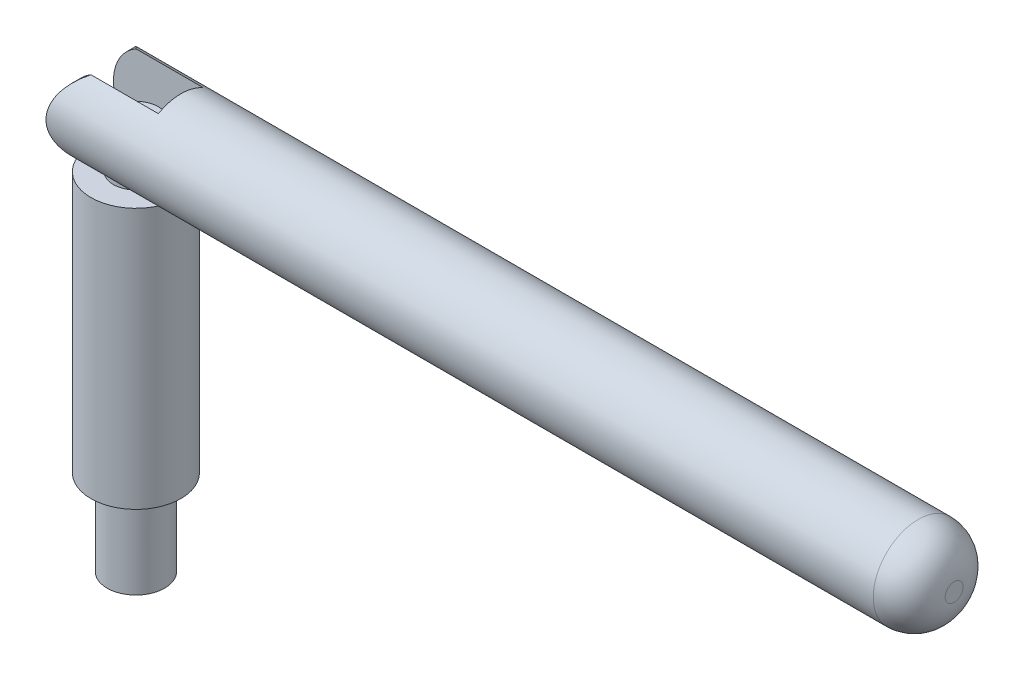
ISO-10303-21;
HEADER;
FILE_DESCRIPTION(('STEP AP214'),'2;1');
FILE_NAME('part.step','',(''),(''),'','','');
FILE_SCHEMA(('AUTOMOTIVE_DESIGN { 1 0 10303 214 1 1 1 1 }'));
ENDSEC;
DATA;
#1=APPLICATION_CONTEXT('core data for automotive mechanical design processes');
#2=APPLICATION_PROTOCOL_DEFINITION('international standard','automotive_design',2000,#1);
#3=PRODUCT_CONTEXT('',#1,'mechanical');
#4=PRODUCT('Part','Part','',(#3));
#5=PRODUCT_RELATED_PRODUCT_CATEGORY('part','',(#4));
#6=PRODUCT_DEFINITION_FORMATION('','',#4);
#7=PRODUCT_DEFINITION_CONTEXT('part definition',#1,'design');
#8=PRODUCT_DEFINITION('design','',#6,#7);
#9=PRODUCT_DEFINITION_SHAPE('','',#8);
#10=(LENGTH_UNIT() NAMED_UNIT(*) SI_UNIT(.MILLI.,.METRE.));
#11=(NAMED_UNIT(*) PLANE_ANGLE_UNIT() SI_UNIT($,.RADIAN.));
#12=(NAMED_UNIT(*) SI_UNIT($,.STERADIAN.) SOLID_ANGLE_UNIT());
#13=UNCERTAINTY_MEASURE_WITH_UNIT(LENGTH_MEASURE(1.E-05),#10,'distance_accuracy_value','');
#14=(GEOMETRIC_REPRESENTATION_CONTEXT(3) GLOBAL_UNCERTAINTY_ASSIGNED_CONTEXT((#13)) GLOBAL_UNIT_ASSIGNED_CONTEXT((#10,
#11,#12)) REPRESENTATION_CONTEXT('',''));
#15=CARTESIAN_POINT('',(0.,0.,0.));
#16=DIRECTION('',(0.,0.,1.));
#17=DIRECTION('',(1.,0.,0.));
#18=AXIS2_PLACEMENT_3D('',#15,#16,#17);
#19=CARTESIAN_POINT('',(-5.,34.,0.));
#20=DIRECTION('',(1.,0.,0.));
#21=DIRECTION('',(0.,0.,-1.));
#22=AXIS2_PLACEMENT_3D('',#19,#20,#21);
#23=CYLINDRICAL_SURFACE('',#22,5.);
#24=CARTESIAN_POINT('',(87.,34.,0.));
#25=DIRECTION('',(1.,0.,0.));
#26=DIRECTION('',(0.,0.,-1.));
#27=AXIS2_PLACEMENT_3D('',#24,#25,#26);
#28=CIRCLE('',#27,5.);
#29=CARTESIAN_POINT('',(87.,34.,-5.));
#30=VERTEX_POINT('',#29);
#31=EDGE_CURVE('E109',#30,#30,#28,.F.);
#32=ORIENTED_EDGE('',*,*,#31,.T.);
#33=EDGE_LOOP('',(#32));
#34=FACE_BOUND('',#33,.T.);
#35=DIRECTION('',(1.,0.,0.));
#36=VECTOR('',#35,1.);
#37=CARTESIAN_POINT('',(-5.,38.3301270189222,2.5));
#38=LINE('',#37,#36);
#39=CARTESIAN_POINT('',(5.,38.3301270189222,2.5));
#40=VERTEX_POINT('',#39);
#41=CARTESIAN_POINT('',(-2.5,38.3301270189222,2.5));
#42=VERTEX_POINT('',#41);
#43=EDGE_CURVE('E104',#40,#42,#38,.F.);
#44=ORIENTED_EDGE('',*,*,#43,.T.);
#45=CARTESIAN_POINT('',(0.,34.,0.));
#46=DIRECTION('',(0.707106781186547,0.,0.707106781186547));
#47=DIRECTION('',(0.707106781186547,0.,-0.707106781186547));
#48=AXIS2_PLACEMENT_3D('',#45,#46,#47);
#49=ELLIPSE('',#48,7.07106781186548,5.);
#50=CARTESIAN_POINT('',(-2.5,29.6698729810778,2.5));
#51=VERTEX_POINT('',#50);
#52=EDGE_CURVE('E119',#42,#51,#49,.T.);
#53=ORIENTED_EDGE('',*,*,#52,.T.);
#54=DIRECTION('',(1.,0.,0.));
#55=VECTOR('',#54,1.);
#56=CARTESIAN_POINT('',(-5.,29.6698729810778,2.5));
#57=LINE('',#56,#55);
#58=CARTESIAN_POINT('',(5.,29.6698729810778,2.5));
#59=VERTEX_POINT('',#58);
#60=EDGE_CURVE('E63',#51,#59,#57,.T.);
#61=ORIENTED_EDGE('',*,*,#60,.T.);
#62=CARTESIAN_POINT('',(5.,34.,0.));
#63=DIRECTION('',(-1.,0.,0.));
#64=DIRECTION('',(0.,0.,1.));
#65=AXIS2_PLACEMENT_3D('',#62,#63,#64);
#66=CIRCLE('',#65,5.);
#67=CARTESIAN_POINT('',(5.,29.6698729810778,-2.5));
#68=VERTEX_POINT('',#67);
#69=EDGE_CURVE('E111',#59,#68,#66,.F.);
#70=ORIENTED_EDGE('',*,*,#69,.T.);
#71=DIRECTION('',(1.,0.,0.));
#72=VECTOR('',#71,1.);
#73=CARTESIAN_POINT('',(-5.,29.6698729810778,-2.5));
#74=LINE('',#73,#72);
#75=CARTESIAN_POINT('',(-2.5,29.6698729810778,-2.5));
#76=VERTEX_POINT('',#75);
#77=EDGE_CURVE('E87',#68,#76,#74,.F.);
#78=ORIENTED_EDGE('',*,*,#77,.T.);
#79=CARTESIAN_POINT('',(0.,34.,0.));
#80=DIRECTION('',(0.707106781186547,0.,-0.707106781186547));
#81=DIRECTION('',(0.707106781186547,0.,0.707106781186547));
#82=AXIS2_PLACEMENT_3D('',#79,#80,#81);
#83=ELLIPSE('',#82,7.07106781186548,5.);
#84=CARTESIAN_POINT('',(-2.5,38.3301270189222,-2.5));
#85=VERTEX_POINT('',#84);
#86=EDGE_CURVE('E56',#76,#85,#83,.T.);
#87=ORIENTED_EDGE('',*,*,#86,.T.);
#88=DIRECTION('',(1.,0.,0.));
#89=VECTOR('',#88,1.);
#90=CARTESIAN_POINT('',(-5.,38.3301270189222,-2.5));
#91=LINE('',#90,#89);
#92=CARTESIAN_POINT('',(5.,38.3301270189222,-2.5));
#93=VERTEX_POINT('',#92);
#94=EDGE_CURVE('E85',#85,#93,#91,.T.);
#95=ORIENTED_EDGE('',*,*,#94,.T.);
#96=EDGE_CURVE('E50',#93,#40,#66,.F.);
#97=ORIENTED_EDGE('',*,*,#96,.T.);
#98=EDGE_LOOP('',(#44,#53,#61,#70,#78,#87,#95,#97));
#99=FACE_BOUND('',#98,.T.);
#100=ADVANCED_FACE('F42',(#34,#99),#23,.T.);
#101=CARTESIAN_POINT('',(5.,39.,2.5));
#102=DIRECTION('',(0.,0.,-1.));
#103=DIRECTION('',(-1.,0.,0.));
#104=AXIS2_PLACEMENT_3D('',#101,#102,#103);
#105=PLANE('',#104);
#106=CARTESIAN_POINT('',(0.,34.,2.5));
#107=DIRECTION('',(0.,0.,-1.));
#108=DIRECTION('',(-1.,0.,0.));
#109=AXIS2_PLACEMENT_3D('',#106,#107,#108);
#110=CIRCLE('',#109,5.);
#111=EDGE_CURVE('E88',#51,#42,#110,.T.);
#112=ORIENTED_EDGE('',*,*,#111,.T.);
#113=ORIENTED_EDGE('',*,*,#43,.F.);
#114=DIRECTION('',(0.,-1.,0.));
#115=VECTOR('',#114,1.);
#116=CARTESIAN_POINT('',(5.,39.,2.5));
#117=LINE('',#116,#115);
#118=EDGE_CURVE('E96',#40,#59,#117,.T.);
#119=ORIENTED_EDGE('',*,*,#118,.T.);
#120=ORIENTED_EDGE('',*,*,#60,.F.);
#121=EDGE_LOOP('',(#112,#113,#119,#120));
#122=FACE_BOUND('',#121,.T.);
#123=ADVANCED_FACE('F116',(#122),#105,.T.);
#124=CARTESIAN_POINT('',(5.,39.,-2.5));
#125=DIRECTION('',(0.,0.,1.));
#126=DIRECTION('',(1.,0.,0.));
#127=AXIS2_PLACEMENT_3D('',#124,#125,#126);
#128=PLANE('',#127);
#129=ORIENTED_EDGE('',*,*,#94,.F.);
#130=CARTESIAN_POINT('',(0.,34.,-2.5));
#131=DIRECTION('',(0.,0.,1.));
#132=DIRECTION('',(1.,0.,0.));
#133=AXIS2_PLACEMENT_3D('',#130,#131,#132);
#134=CIRCLE('',#133,5.);
#135=EDGE_CURVE('E13',#85,#76,#134,.T.);
#136=ORIENTED_EDGE('',*,*,#135,.T.);
#137=ORIENTED_EDGE('',*,*,#77,.F.);
#138=DIRECTION('',(0.,-1.,0.));
#139=VECTOR('',#138,1.);
#140=CARTESIAN_POINT('',(5.,39.,-2.5));
#141=LINE('',#140,#139);
#142=EDGE_CURVE('E95',#93,#68,#141,.T.);
#143=ORIENTED_EDGE('',*,*,#142,.F.);
#144=EDGE_LOOP('',(#129,#136,#137,#143));
#145=FACE_BOUND('',#144,.T.);
#146=ADVANCED_FACE('F93',(#145),#128,.T.);
#147=CARTESIAN_POINT('',(91.,34.,0.));
#148=DIRECTION('',(1.,0.,0.));
#149=DIRECTION('',(0.,0.,-1.));
#150=AXIS2_PLACEMENT_3D('',#147,#148,#149);
#151=PLANE('',#150);
#152=CARTESIAN_POINT('',(91.,34.,0.));
#153=DIRECTION('',(1.,0.,0.));
#154=DIRECTION('',(0.,0.,-1.));
#155=AXIS2_PLACEMENT_3D('',#152,#153,#154);
#156=CIRCLE('',#155,1.);
#157=CARTESIAN_POINT('',(91.,34.,-1.));
#158=VERTEX_POINT('',#157);
#159=EDGE_CURVE('E106',#158,#158,#156,.T.);
#160=ORIENTED_EDGE('',*,*,#159,.T.);
#161=EDGE_LOOP('',(#160));
#162=FACE_BOUND('',#161,.T.);
#163=ADVANCED_FACE('F136',(#162),#151,.T.);
#164=CARTESIAN_POINT('',(87.,34.,0.));
#165=DIRECTION('',(1.,0.,0.));
#166=DIRECTION('',(0.,0.,-1.));
#167=AXIS2_PLACEMENT_3D('',#164,#165,#166);
#168=DEGENERATE_TOROIDAL_SURFACE('',#167,1.,4.,.T.);
#169=ORIENTED_EDGE('',*,*,#31,.F.);
#170=EDGE_LOOP('',(#169));
#171=FACE_BOUND('',#170,.T.);
#172=ORIENTED_EDGE('',*,*,#159,.F.);
#173=EDGE_LOOP('',(#172));
#174=FACE_BOUND('',#173,.T.);
#175=ADVANCED_FACE('F44',(#171,#174),#168,.T.);
#176=CARTESIAN_POINT('',(5.,39.,-2.5));
#177=DIRECTION('',(-1.,0.,0.));
#178=DIRECTION('',(0.,0.,1.));
#179=AXIS2_PLACEMENT_3D('',#176,#177,#178);
#180=PLANE('',#179);
#181=ORIENTED_EDGE('',*,*,#118,.F.);
#182=ORIENTED_EDGE('',*,*,#96,.F.);
#183=ORIENTED_EDGE('',*,*,#142,.T.);
#184=ORIENTED_EDGE('',*,*,#69,.F.);
#185=EDGE_LOOP('',(#181,#182,#183,#184));
#186=FACE_BOUND('',#185,.T.);
#187=ADVANCED_FACE('F114',(#186),#180,.T.);
#188=CARTESIAN_POINT('',(0.,34.,-5.));
#189=DIRECTION('',(0.,0.,1.));
#190=DIRECTION('',(1.,0.,0.));
#191=AXIS2_PLACEMENT_3D('',#188,#189,#190);
#192=CYLINDRICAL_SURFACE('',#191,5.);
#193=ORIENTED_EDGE('',*,*,#135,.F.);
#194=ORIENTED_EDGE('',*,*,#86,.F.);
#195=EDGE_LOOP('',(#193,#194));
#196=FACE_BOUND('',#195,.T.);
#197=ADVANCED_FACE('F90',(#196),#192,.T.);
#198=ORIENTED_EDGE('',*,*,#52,.F.);
#199=ORIENTED_EDGE('',*,*,#111,.F.);
#200=EDGE_LOOP('',(#198,#199));
#201=FACE_BOUND('',#200,.T.);
#202=ADVANCED_FACE('F121',(#201),#192,.T.);
#203=CLOSED_SHELL('',(#100,#123,#146,#163,#175,#187,#197,#202));
#204=MANIFOLD_SOLID_BREP('B2',#203);
#205=CARTESIAN_POINT('',(0.,0.,0.));
#206=DIRECTION('',(0.,1.,0.));
#207=DIRECTION('',(0.,0.,1.));
#208=AXIS2_PLACEMENT_3D('',#205,#206,#207);
#209=PLANE('',#208);
#210=CARTESIAN_POINT('',(0.,0.,0.));
#211=DIRECTION('',(0.,1.,0.));
#212=DIRECTION('',(0.,0.,1.));
#213=AXIS2_PLACEMENT_3D('',#210,#211,#212);
#214=CIRCLE('',#213,5.);
#215=CARTESIAN_POINT('',(0.,0.,5.));
#216=VERTEX_POINT('',#215);
#217=EDGE_CURVE('E211',#216,#216,#214,.T.);
#218=ORIENTED_EDGE('',*,*,#217,.F.);
#219=EDGE_LOOP('',(#218));
#220=FACE_BOUND('',#219,.T.);
#221=CARTESIAN_POINT('',(0.,0.,0.));
#222=DIRECTION('',(0.,1.,0.));
#223=DIRECTION('',(0.,0.,1.));
#224=AXIS2_PLACEMENT_3D('',#221,#222,#223);
#225=CIRCLE('',#224,3.2);
#226=CARTESIAN_POINT('',(0.,0.,3.2));
#227=VERTEX_POINT('',#226);
#228=EDGE_CURVE('E41',#227,#227,#225,.F.);
#229=ORIENTED_EDGE('',*,*,#228,.F.);
#230=EDGE_LOOP('',(#229));
#231=FACE_BOUND('',#230,.T.);
#232=ADVANCED_FACE('F200',(#220,#231),#209,.F.);
#233=CARTESIAN_POINT('',(0.,29.,0.));
#234=DIRECTION('',(0.,1.,0.));
#235=DIRECTION('',(0.,0.,1.));
#236=AXIS2_PLACEMENT_3D('',#233,#234,#235);
#237=PLANE('',#236);
#238=CARTESIAN_POINT('',(0.,29.,0.));
#239=DIRECTION('',(0.,1.,0.));
#240=DIRECTION('',(0.,0.,1.));
#241=AXIS2_PLACEMENT_3D('',#238,#239,#240);
#242=CIRCLE('',#241,5.);
#243=CARTESIAN_POINT('',(0.,29.,5.));
#244=VERTEX_POINT('',#243);
#245=EDGE_CURVE('E207',#244,#244,#242,.T.);
#246=ORIENTED_EDGE('',*,*,#245,.T.);
#247=EDGE_LOOP('',(#246));
#248=FACE_BOUND('',#247,.T.);
#249=CARTESIAN_POINT('',(0.,29.,0.));
#250=DIRECTION('',(0.,1.,0.));
#251=DIRECTION('',(0.,0.,1.));
#252=AXIS2_PLACEMENT_3D('',#249,#250,#251);
#253=CIRCLE('',#252,2.5);
#254=CARTESIAN_POINT('',(0.,29.,2.5));
#255=VERTEX_POINT('',#254);
#256=EDGE_CURVE('E218',#255,#255,#253,.T.);
#257=ORIENTED_EDGE('',*,*,#256,.F.);
#258=EDGE_LOOP('',(#257));
#259=FACE_BOUND('',#258,.T.);
#260=ADVANCED_FACE('F242',(#248,#259),#237,.T.);
#261=CARTESIAN_POINT('',(0.,29.,0.));
#262=DIRECTION('',(0.,-1.,0.));
#263=DIRECTION('',(0.,0.,-1.));
#264=AXIS2_PLACEMENT_3D('',#261,#262,#263);
#265=CYLINDRICAL_SURFACE('',#264,5.);
#266=ORIENTED_EDGE('',*,*,#245,.F.);
#267=EDGE_LOOP('',(#266));
#268=FACE_BOUND('',#267,.T.);
#269=ORIENTED_EDGE('',*,*,#217,.T.);
#270=EDGE_LOOP('',(#269));
#271=FACE_BOUND('',#270,.T.);
#272=ADVANCED_FACE('F202',(#268,#271),#265,.T.);
#273=CARTESIAN_POINT('',(0.,34.,0.));
#274=DIRECTION('',(0.,-1.,0.));
#275=DIRECTION('',(0.,0.,-1.));
#276=AXIS2_PLACEMENT_3D('',#273,#274,#275);
#277=CYLINDRICAL_SURFACE('',#276,2.5);
#278=CARTESIAN_POINT('',(0.,34.,0.));
#279=DIRECTION('',(0.,1.,0.));
#280=DIRECTION('',(0.,0.,1.));
#281=AXIS2_PLACEMENT_3D('',#278,#279,#280);
#282=CIRCLE('',#281,2.5);
#283=CARTESIAN_POINT('',(0.,34.,2.5));
#284=VERTEX_POINT('',#283);
#285=EDGE_CURVE('E216',#284,#284,#282,.T.);
#286=ORIENTED_EDGE('',*,*,#285,.F.);
#287=EDGE_LOOP('',(#286));
#288=FACE_BOUND('',#287,.T.);
#289=ORIENTED_EDGE('',*,*,#256,.T.);
#290=EDGE_LOOP('',(#289));
#291=FACE_BOUND('',#290,.T.);
#292=ADVANCED_FACE('F238',(#288,#291),#277,.T.);
#293=CARTESIAN_POINT('',(0.,34.,0.));
#294=DIRECTION('',(0.,1.,0.));
#295=DIRECTION('',(0.,0.,1.));
#296=AXIS2_PLACEMENT_3D('',#293,#294,#295);
#297=PLANE('',#296);
#298=ORIENTED_EDGE('',*,*,#285,.T.);
#299=EDGE_LOOP('',(#298));
#300=FACE_BOUND('',#299,.T.);
#301=ADVANCED_FACE('F231',(#300),#297,.T.);
#302=CARTESIAN_POINT('',(0.,-9.525,0.));
#303=DIRECTION('',(0.,1.,0.));
#304=DIRECTION('',(0.,0.,1.));
#305=AXIS2_PLACEMENT_3D('',#302,#303,#304);
#306=CYLINDRICAL_SURFACE('',#305,3.2);
#307=CARTESIAN_POINT('',(0.,-9.525,0.));
#308=DIRECTION('',(0.,-1.,0.));
#309=DIRECTION('',(0.,0.,-1.));
#310=AXIS2_PLACEMENT_3D('',#307,#308,#309);
#311=CIRCLE('',#310,3.2);
#312=CARTESIAN_POINT('',(0.,-9.525,-3.2));
#313=VERTEX_POINT('',#312);
#314=EDGE_CURVE('E221',#313,#313,#311,.T.);
#315=ORIENTED_EDGE('',*,*,#314,.F.);
#316=EDGE_LOOP('',(#315));
#317=FACE_BOUND('',#316,.T.);
#318=ORIENTED_EDGE('',*,*,#228,.T.);
#319=EDGE_LOOP('',(#318));
#320=FACE_BOUND('',#319,.T.);
#321=ADVANCED_FACE('F229',(#317,#320),#306,.T.);
#322=CARTESIAN_POINT('',(0.,-9.525,0.));
#323=DIRECTION('',(0.,-1.,0.));
#324=DIRECTION('',(0.,0.,-1.));
#325=AXIS2_PLACEMENT_3D('',#322,#323,#324);
#326=PLANE('',#325);
#327=ORIENTED_EDGE('',*,*,#314,.T.);
#328=EDGE_LOOP('',(#327));
#329=FACE_BOUND('',#328,.T.);
#330=ADVANCED_FACE('F227',(#329),#326,.T.);
#331=CLOSED_SHELL('',(#232,#260,#272,#292,#301,#321,#330));
#332=MANIFOLD_SOLID_BREP('B7',#331);
#333=ADVANCED_BREP_SHAPE_REPRESENTATION('',(#18,#204,#332),#14);
#334=SHAPE_DEFINITION_REPRESENTATION(#9,#333);
ENDSEC;
END-ISO-10303-21;
